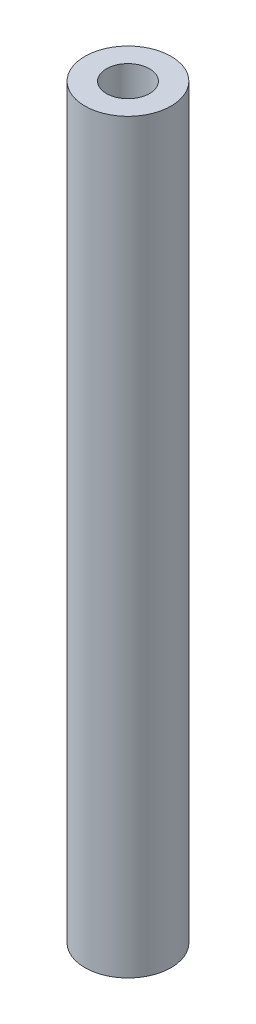
ISO-10303-21;
HEADER;
FILE_DESCRIPTION(('STEP AP214'),'2;1');
FILE_NAME('part.step','',(''),(''),'','','');
FILE_SCHEMA(('AUTOMOTIVE_DESIGN { 1 0 10303 214 1 1 1 1 }'));
ENDSEC;
DATA;
#1=APPLICATION_CONTEXT('core data for automotive mechanical design processes');
#2=APPLICATION_PROTOCOL_DEFINITION('international standard','automotive_design',2000,#1);
#3=PRODUCT_CONTEXT('',#1,'mechanical');
#4=PRODUCT('Part','Part','',(#3));
#5=PRODUCT_RELATED_PRODUCT_CATEGORY('part','',(#4));
#6=PRODUCT_DEFINITION_FORMATION('','',#4);
#7=PRODUCT_DEFINITION_CONTEXT('part definition',#1,'design');
#8=PRODUCT_DEFINITION('design','',#6,#7);
#9=PRODUCT_DEFINITION_SHAPE('','',#8);
#10=(LENGTH_UNIT() NAMED_UNIT(*) SI_UNIT(.MILLI.,.METRE.));
#11=(NAMED_UNIT(*) PLANE_ANGLE_UNIT() SI_UNIT($,.RADIAN.));
#12=(NAMED_UNIT(*) SI_UNIT($,.STERADIAN.) SOLID_ANGLE_UNIT());
#13=UNCERTAINTY_MEASURE_WITH_UNIT(LENGTH_MEASURE(1.E-05),#10,'distance_accuracy_value','');
#14=(GEOMETRIC_REPRESENTATION_CONTEXT(3) GLOBAL_UNCERTAINTY_ASSIGNED_CONTEXT((#13)) GLOBAL_UNIT_ASSIGNED_CONTEXT((#10,
#11,#12)) REPRESENTATION_CONTEXT('',''));
#15=CARTESIAN_POINT('',(0.,0.,0.));
#16=DIRECTION('',(0.,0.,1.));
#17=DIRECTION('',(1.,0.,0.));
#18=AXIS2_PLACEMENT_3D('',#15,#16,#17);
#19=CARTESIAN_POINT('',(0.,27.5,0.));
#20=DIRECTION('',(0.,1.,0.));
#21=DIRECTION('',(0.,0.,1.));
#22=AXIS2_PLACEMENT_3D('',#19,#20,#21);
#23=PLANE('',#22);
#24=CARTESIAN_POINT('',(0.,27.5,0.));
#25=DIRECTION('',(0.,1.,0.));
#26=DIRECTION('',(0.,0.,1.));
#27=AXIS2_PLACEMENT_3D('',#24,#25,#26);
#28=CIRCLE('',#27,1.5875);
#29=CARTESIAN_POINT('',(0.,27.5,1.5875));
#30=VERTEX_POINT('',#29);
#31=EDGE_CURVE('E10',#30,#30,#28,.T.);
#32=ORIENTED_EDGE('',*,*,#31,.T.);
#33=EDGE_LOOP('',(#32));
#34=FACE_BOUND('',#33,.T.);
#35=CARTESIAN_POINT('',(0.,27.5,0.));
#36=DIRECTION('',(0.,1.,0.));
#37=DIRECTION('',(0.,0.,1.));
#38=AXIS2_PLACEMENT_3D('',#35,#36,#37);
#39=CIRCLE('',#38,0.79375);
#40=CARTESIAN_POINT('',(0.,27.5,0.79375));
#41=VERTEX_POINT('',#40);
#42=EDGE_CURVE('E48',#41,#41,#39,.T.);
#43=ORIENTED_EDGE('',*,*,#42,.F.);
#44=EDGE_LOOP('',(#43));
#45=FACE_BOUND('',#44,.T.);
#46=ADVANCED_FACE('F37',(#34,#45),#23,.T.);
#47=CARTESIAN_POINT('',(0.,0.,0.));
#48=DIRECTION('',(0.,1.,0.));
#49=DIRECTION('',(0.,0.,1.));
#50=AXIS2_PLACEMENT_3D('',#47,#48,#49);
#51=PLANE('',#50);
#52=CARTESIAN_POINT('',(0.,0.,0.));
#53=DIRECTION('',(0.,1.,0.));
#54=DIRECTION('',(0.,0.,1.));
#55=AXIS2_PLACEMENT_3D('',#52,#53,#54);
#56=CIRCLE('',#55,1.5875);
#57=CARTESIAN_POINT('',(0.,0.,1.5875));
#58=VERTEX_POINT('',#57);
#59=EDGE_CURVE('E41',#58,#58,#56,.T.);
#60=ORIENTED_EDGE('',*,*,#59,.F.);
#61=EDGE_LOOP('',(#60));
#62=FACE_BOUND('',#61,.T.);
#63=CARTESIAN_POINT('',(0.,0.,0.));
#64=DIRECTION('',(0.,1.,0.));
#65=DIRECTION('',(0.,0.,1.));
#66=AXIS2_PLACEMENT_3D('',#63,#64,#65);
#67=CIRCLE('',#66,0.79375);
#68=CARTESIAN_POINT('',(0.,0.,0.79375));
#69=VERTEX_POINT('',#68);
#70=EDGE_CURVE('E50',#69,#69,#67,.T.);
#71=ORIENTED_EDGE('',*,*,#70,.T.);
#72=EDGE_LOOP('',(#71));
#73=FACE_BOUND('',#72,.T.);
#74=ADVANCED_FACE('F60',(#62,#73),#51,.F.);
#75=CARTESIAN_POINT('',(0.,27.5,0.));
#76=DIRECTION('',(0.,-1.,0.));
#77=DIRECTION('',(0.,0.,-1.));
#78=AXIS2_PLACEMENT_3D('',#75,#76,#77);
#79=CYLINDRICAL_SURFACE('',#78,1.5875);
#80=ORIENTED_EDGE('',*,*,#31,.F.);
#81=EDGE_LOOP('',(#80));
#82=FACE_BOUND('',#81,.T.);
#83=ORIENTED_EDGE('',*,*,#59,.T.);
#84=EDGE_LOOP('',(#83));
#85=FACE_BOUND('',#84,.T.);
#86=ADVANCED_FACE('F39',(#82,#85),#79,.T.);
#87=CARTESIAN_POINT('',(0.,27.5,0.));
#88=DIRECTION('',(0.,-1.,0.));
#89=DIRECTION('',(0.,0.,-1.));
#90=AXIS2_PLACEMENT_3D('',#87,#88,#89);
#91=CYLINDRICAL_SURFACE('',#90,0.79375);
#92=ORIENTED_EDGE('',*,*,#42,.T.);
#93=EDGE_LOOP('',(#92));
#94=FACE_BOUND('',#93,.T.);
#95=ORIENTED_EDGE('',*,*,#70,.F.);
#96=EDGE_LOOP('',(#95));
#97=FACE_BOUND('',#96,.T.);
#98=ADVANCED_FACE('F56',(#94,#97),#91,.F.);
#99=CLOSED_SHELL('',(#46,#74,#86,#98));
#100=MANIFOLD_SOLID_BREP('B2',#99);
#101=ADVANCED_BREP_SHAPE_REPRESENTATION('',(#18,#100),#14);
#102=SHAPE_DEFINITION_REPRESENTATION(#9,#101);
ENDSEC;
END-ISO-10303-21;
